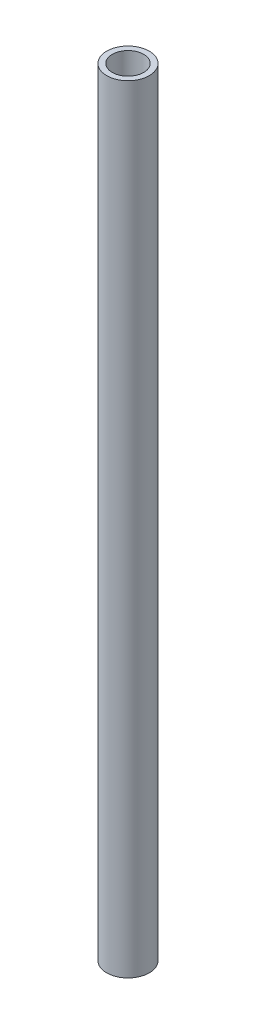
ISO-10303-21;
HEADER;
FILE_DESCRIPTION(('STEP AP214'),'2;1');
FILE_NAME('part.step','',(''),(''),'','','');
FILE_SCHEMA(('AUTOMOTIVE_DESIGN { 1 0 10303 214 1 1 1 1 }'));
ENDSEC;
DATA;
#1=APPLICATION_CONTEXT('core data for automotive mechanical design processes');
#2=APPLICATION_PROTOCOL_DEFINITION('international standard','automotive_design',2000,#1);
#3=PRODUCT_CONTEXT('',#1,'mechanical');
#4=PRODUCT('Part','Part','',(#3));
#5=PRODUCT_RELATED_PRODUCT_CATEGORY('part','',(#4));
#6=PRODUCT_DEFINITION_FORMATION('','',#4);
#7=PRODUCT_DEFINITION_CONTEXT('part definition',#1,'design');
#8=PRODUCT_DEFINITION('design','',#6,#7);
#9=PRODUCT_DEFINITION_SHAPE('','',#8);
#10=(LENGTH_UNIT() NAMED_UNIT(*) SI_UNIT(.MILLI.,.METRE.));
#11=(NAMED_UNIT(*) PLANE_ANGLE_UNIT() SI_UNIT($,.RADIAN.));
#12=(NAMED_UNIT(*) SI_UNIT($,.STERADIAN.) SOLID_ANGLE_UNIT());
#13=UNCERTAINTY_MEASURE_WITH_UNIT(LENGTH_MEASURE(1.E-05),#10,'distance_accuracy_value','');
#14=(GEOMETRIC_REPRESENTATION_CONTEXT(3) GLOBAL_UNCERTAINTY_ASSIGNED_CONTEXT((#13)) GLOBAL_UNIT_ASSIGNED_CONTEXT((#10,
#11,#12)) REPRESENTATION_CONTEXT('',''));
#15=CARTESIAN_POINT('',(0.,0.,0.));
#16=DIRECTION('',(0.,0.,1.));
#17=DIRECTION('',(1.,0.,0.));
#18=AXIS2_PLACEMENT_3D('',#15,#16,#17);
#19=CARTESIAN_POINT('',(0.,210.,0.));
#20=DIRECTION('',(0.,1.,0.));
#21=DIRECTION('',(0.,0.,1.));
#22=AXIS2_PLACEMENT_3D('',#19,#20,#21);
#23=PLANE('',#22);
#24=CARTESIAN_POINT('',(0.,210.,0.));
#25=DIRECTION('',(0.,1.,0.));
#26=DIRECTION('',(0.,0.,1.));
#27=AXIS2_PLACEMENT_3D('',#24,#25,#26);
#28=CIRCLE('',#27,11.5);
#29=CARTESIAN_POINT('',(0.,210.,11.5));
#30=VERTEX_POINT('',#29);
#31=EDGE_CURVE('E10',#30,#30,#28,.T.);
#32=ORIENTED_EDGE('',*,*,#31,.T.);
#33=EDGE_LOOP('',(#32));
#34=FACE_BOUND('',#33,.T.);
#35=CARTESIAN_POINT('',(0.,210.,0.));
#36=DIRECTION('',(0.,1.,0.));
#37=DIRECTION('',(0.,0.,1.));
#38=AXIS2_PLACEMENT_3D('',#35,#36,#37);
#39=CIRCLE('',#38,8.5);
#40=CARTESIAN_POINT('',(0.,210.,8.5));
#41=VERTEX_POINT('',#40);
#42=EDGE_CURVE('E42',#41,#41,#39,.T.);
#43=ORIENTED_EDGE('',*,*,#42,.F.);
#44=EDGE_LOOP('',(#43));
#45=FACE_BOUND('',#44,.T.);
#46=ADVANCED_FACE('F31',(#34,#45),#23,.T.);
#47=CARTESIAN_POINT('',(0.,-210.,0.));
#48=DIRECTION('',(0.,1.,0.));
#49=DIRECTION('',(0.,0.,1.));
#50=AXIS2_PLACEMENT_3D('',#47,#48,#49);
#51=PLANE('',#50);
#52=CARTESIAN_POINT('',(0.,-210.,0.));
#53=DIRECTION('',(0.,1.,0.));
#54=DIRECTION('',(0.,0.,1.));
#55=AXIS2_PLACEMENT_3D('',#52,#53,#54);
#56=CIRCLE('',#55,11.5);
#57=CARTESIAN_POINT('',(0.,-210.,11.5));
#58=VERTEX_POINT('',#57);
#59=EDGE_CURVE('E35',#58,#58,#56,.T.);
#60=ORIENTED_EDGE('',*,*,#59,.F.);
#61=EDGE_LOOP('',(#60));
#62=FACE_BOUND('',#61,.T.);
#63=CARTESIAN_POINT('',(0.,-210.,0.));
#64=DIRECTION('',(0.,1.,0.));
#65=DIRECTION('',(0.,0.,1.));
#66=AXIS2_PLACEMENT_3D('',#63,#64,#65);
#67=CIRCLE('',#66,8.5);
#68=CARTESIAN_POINT('',(0.,-210.,8.5));
#69=VERTEX_POINT('',#68);
#70=EDGE_CURVE('E44',#69,#69,#67,.T.);
#71=ORIENTED_EDGE('',*,*,#70,.T.);
#72=EDGE_LOOP('',(#71));
#73=FACE_BOUND('',#72,.T.);
#74=ADVANCED_FACE('F54',(#62,#73),#51,.F.);
#75=CARTESIAN_POINT('',(0.,210.,0.));
#76=DIRECTION('',(0.,-1.,0.));
#77=DIRECTION('',(0.,0.,-1.));
#78=AXIS2_PLACEMENT_3D('',#75,#76,#77);
#79=CYLINDRICAL_SURFACE('',#78,11.5);
#80=ORIENTED_EDGE('',*,*,#31,.F.);
#81=EDGE_LOOP('',(#80));
#82=FACE_BOUND('',#81,.T.);
#83=ORIENTED_EDGE('',*,*,#59,.T.);
#84=EDGE_LOOP('',(#83));
#85=FACE_BOUND('',#84,.T.);
#86=ADVANCED_FACE('F33',(#82,#85),#79,.T.);
#87=CARTESIAN_POINT('',(0.,210.,0.));
#88=DIRECTION('',(0.,-1.,0.));
#89=DIRECTION('',(0.,0.,-1.));
#90=AXIS2_PLACEMENT_3D('',#87,#88,#89);
#91=CYLINDRICAL_SURFACE('',#90,8.5);
#92=ORIENTED_EDGE('',*,*,#42,.T.);
#93=EDGE_LOOP('',(#92));
#94=FACE_BOUND('',#93,.T.);
#95=ORIENTED_EDGE('',*,*,#70,.F.);
#96=EDGE_LOOP('',(#95));
#97=FACE_BOUND('',#96,.T.);
#98=ADVANCED_FACE('F50',(#94,#97),#91,.F.);
#99=CLOSED_SHELL('',(#46,#74,#86,#98));
#100=MANIFOLD_SOLID_BREP('B2',#99);
#101=ADVANCED_BREP_SHAPE_REPRESENTATION('',(#18,#100),#14);
#102=SHAPE_DEFINITION_REPRESENTATION(#9,#101);
ENDSEC;
END-ISO-10303-21;
